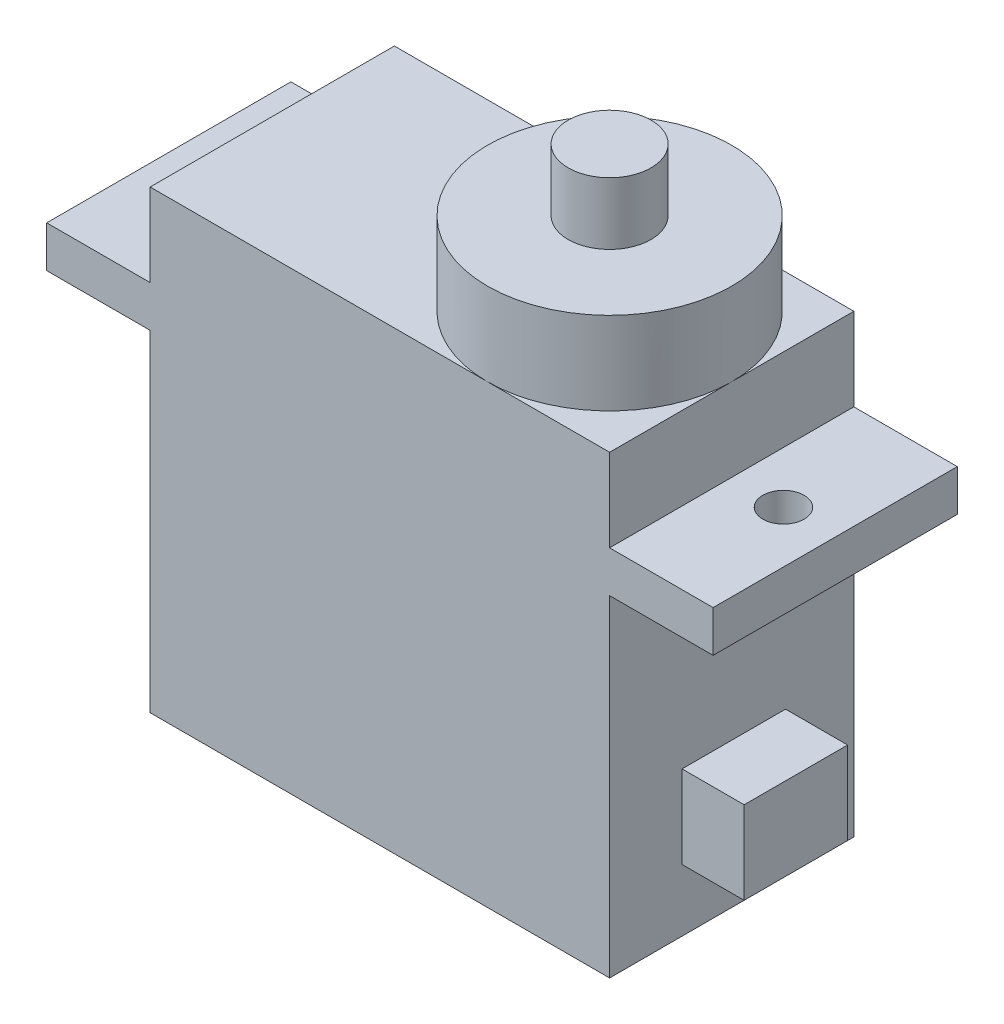
ISO-10303-21;
HEADER;
FILE_DESCRIPTION(('STEP AP214'),'2;1');
FILE_NAME('part.step','',(''),(''),'','','');
FILE_SCHEMA(('AUTOMOTIVE_DESIGN { 1 0 10303 214 1 1 1 1 }'));
ENDSEC;
DATA;
#1=APPLICATION_CONTEXT('core data for automotive mechanical design processes');
#2=APPLICATION_PROTOCOL_DEFINITION('international standard','automotive_design',2000,#1);
#3=PRODUCT_CONTEXT('',#1,'mechanical');
#4=PRODUCT('Part','Part','',(#3));
#5=PRODUCT_RELATED_PRODUCT_CATEGORY('part','',(#4));
#6=PRODUCT_DEFINITION_FORMATION('','',#4);
#7=PRODUCT_DEFINITION_CONTEXT('part definition',#1,'design');
#8=PRODUCT_DEFINITION('design','',#6,#7);
#9=PRODUCT_DEFINITION_SHAPE('','',#8);
#10=(LENGTH_UNIT() NAMED_UNIT(*) SI_UNIT(.MILLI.,.METRE.));
#11=(NAMED_UNIT(*) PLANE_ANGLE_UNIT() SI_UNIT($,.RADIAN.));
#12=(NAMED_UNIT(*) SI_UNIT($,.STERADIAN.) SOLID_ANGLE_UNIT());
#13=UNCERTAINTY_MEASURE_WITH_UNIT(LENGTH_MEASURE(1.E-05),#10,'distance_accuracy_value','');
#14=(GEOMETRIC_REPRESENTATION_CONTEXT(3) GLOBAL_UNCERTAINTY_ASSIGNED_CONTEXT((#13)) GLOBAL_UNIT_ASSIGNED_CONTEXT((#10,
#11,#12)) REPRESENTATION_CONTEXT('',''));
#15=CARTESIAN_POINT('',(0.,0.,0.));
#16=DIRECTION('',(0.,0.,1.));
#17=DIRECTION('',(1.,0.,0.));
#18=AXIS2_PLACEMENT_3D('',#15,#16,#17);
#19=CARTESIAN_POINT('',(-17.9964599489545,16.,11.8));
#20=DIRECTION('',(-1.,0.,0.));
#21=DIRECTION('',(0.,0.,1.));
#22=AXIS2_PLACEMENT_3D('',#19,#20,#21);
#23=PLANE('',#22);
#24=DIRECTION('',(0.,1.,0.));
#25=VECTOR('',#24,1.);
#26=CARTESIAN_POINT('',(-17.9964599489545,16.,0.));
#27=LINE('',#26,#25);
#28=CARTESIAN_POINT('',(-17.9964599489545,0.,0.));
#29=VERTEX_POINT('',#28);
#30=CARTESIAN_POINT('',(-17.9964599489545,16.,0.));
#31=VERTEX_POINT('',#30);
#32=EDGE_CURVE('E242',#29,#31,#27,.T.);
#33=ORIENTED_EDGE('',*,*,#32,.T.);
#34=DIRECTION('',(0.,0.,-1.));
#35=VECTOR('',#34,1.);
#36=CARTESIAN_POINT('',(-17.9964599489545,16.,11.8));
#37=LINE('',#36,#35);
#38=CARTESIAN_POINT('',(-17.9964599489545,16.,11.8));
#39=VERTEX_POINT('',#38);
#40=EDGE_CURVE('E281',#39,#31,#37,.T.);
#41=ORIENTED_EDGE('',*,*,#40,.F.);
#42=DIRECTION('',(0.,1.,0.));
#43=VECTOR('',#42,1.);
#44=CARTESIAN_POINT('',(-17.9964599489545,16.,11.8));
#45=LINE('',#44,#43);
#46=CARTESIAN_POINT('',(-17.9964599489545,0.,11.8));
#47=VERTEX_POINT('',#46);
#48=EDGE_CURVE('E216',#47,#39,#45,.T.);
#49=ORIENTED_EDGE('',*,*,#48,.F.);
#50=DIRECTION('',(0.,0.,-1.));
#51=VECTOR('',#50,1.);
#52=CARTESIAN_POINT('',(-17.9964599489545,0.,11.8));
#53=LINE('',#52,#51);
#54=EDGE_CURVE('E284',#47,#29,#53,.T.);
#55=ORIENTED_EDGE('',*,*,#54,.T.);
#56=EDGE_LOOP('',(#33,#41,#49,#55));
#57=FACE_BOUND('',#56,.T.);
#58=DIRECTION('',(0.,-1.,0.));
#59=VECTOR('',#58,1.);
#60=CARTESIAN_POINT('',(-17.9964599489545,2.99999999999999,8.3));
#61=LINE('',#60,#59);
#62=CARTESIAN_POINT('',(-17.9964599489545,6.99999999999999,8.3));
#63=VERTEX_POINT('',#62);
#64=CARTESIAN_POINT('',(-17.9964599489545,3.,8.3));
#65=VERTEX_POINT('',#64);
#66=EDGE_CURVE('E177',#63,#65,#61,.T.);
#67=ORIENTED_EDGE('',*,*,#66,.F.);
#68=DIRECTION('',(0.,0.,1.));
#69=VECTOR('',#68,1.);
#70=CARTESIAN_POINT('',(-17.9964599489545,6.99999999999999,8.3));
#71=LINE('',#70,#69);
#72=CARTESIAN_POINT('',(-17.9964599489545,7.,3.3));
#73=VERTEX_POINT('',#72);
#74=EDGE_CURVE('E174',#73,#63,#71,.T.);
#75=ORIENTED_EDGE('',*,*,#74,.F.);
#76=DIRECTION('',(0.,1.,0.));
#77=VECTOR('',#76,1.);
#78=CARTESIAN_POINT('',(-17.9964599489545,2.99999999999999,3.3));
#79=LINE('',#78,#77);
#80=CARTESIAN_POINT('',(-17.9964599489545,2.99999999999999,3.3));
#81=VERTEX_POINT('',#80);
#82=EDGE_CURVE('E55',#81,#73,#79,.T.);
#83=ORIENTED_EDGE('',*,*,#82,.F.);
#84=DIRECTION('',(0.,0.,-1.));
#85=VECTOR('',#84,1.);
#86=CARTESIAN_POINT('',(-17.9964599489545,2.99999999999999,8.3));
#87=LINE('',#86,#85);
#88=EDGE_CURVE('E50',#65,#81,#87,.T.);
#89=ORIENTED_EDGE('',*,*,#88,.F.);
#90=EDGE_LOOP('',(#67,#75,#83,#89));
#91=FACE_BOUND('',#90,.T.);
#92=ADVANCED_FACE('F32',(#57,#91),#23,.F.);
#93=CARTESIAN_POINT('',(-23.8964599489545,26.,5.9));
#94=DIRECTION('',(0.,1.,0.));
#95=DIRECTION('',(0.,0.,1.));
#96=AXIS2_PLACEMENT_3D('',#93,#94,#95);
#97=PLANE('',#96);
#98=CARTESIAN_POINT('',(-23.8964599489545,26.,5.9));
#99=DIRECTION('',(0.,1.,0.));
#100=DIRECTION('',(0.,0.,1.));
#101=AXIS2_PLACEMENT_3D('',#98,#99,#100);
#102=CIRCLE('',#101,5.9);
#103=CARTESIAN_POINT('',(-23.8964599489545,26.,11.8));
#104=VERTEX_POINT('',#103);
#105=EDGE_CURVE('E189',#104,#104,#102,.T.);
#106=ORIENTED_EDGE('',*,*,#105,.T.);
#107=EDGE_LOOP('',(#106));
#108=FACE_BOUND('',#107,.T.);
#109=CARTESIAN_POINT('',(-23.8964599489545,26.,5.9));
#110=DIRECTION('',(0.,1.,0.));
#111=DIRECTION('',(0.,0.,1.));
#112=AXIS2_PLACEMENT_3D('',#109,#110,#111);
#113=CIRCLE('',#112,2.);
#114=CARTESIAN_POINT('',(-23.8964599489545,26.,7.9));
#115=VERTEX_POINT('',#114);
#116=EDGE_CURVE('E178',#115,#115,#113,.T.);
#117=ORIENTED_EDGE('',*,*,#116,.F.);
#118=EDGE_LOOP('',(#117));
#119=FACE_BOUND('',#118,.T.);
#120=ADVANCED_FACE('F364',(#108,#119),#97,.T.);
#121=CARTESIAN_POINT('',(-40.1964599489545,22.,11.8));
#122=DIRECTION('',(0.,-1.,0.));
#123=DIRECTION('',(0.,0.,-1.));
#124=AXIS2_PLACEMENT_3D('',#121,#122,#123);
#125=PLANE('',#124);
#126=CARTESIAN_POINT('',(-23.8964599489545,22.,5.9));
#127=DIRECTION('',(0.,1.,0.));
#128=DIRECTION('',(0.,0.,1.));
#129=AXIS2_PLACEMENT_3D('',#126,#127,#128);
#130=CIRCLE('',#129,5.9);
#131=CARTESIAN_POINT('',(-23.8964599489545,22.,11.8));
#132=VERTEX_POINT('',#131);
#133=CARTESIAN_POINT('',(-17.9964599489545,22.,5.9));
#134=VERTEX_POINT('',#133);
#135=EDGE_CURVE('E43',#132,#134,#130,.T.);
#136=ORIENTED_EDGE('',*,*,#135,.F.);
#137=DIRECTION('',(-1.,0.,0.));
#138=VECTOR('',#137,1.);
#139=CARTESIAN_POINT('',(-40.1964599489545,22.,11.8));
#140=LINE('',#139,#138);
#141=CARTESIAN_POINT('',(-17.9964599489545,22.,11.8));
#142=VERTEX_POINT('',#141);
#143=EDGE_CURVE('E227',#142,#132,#140,.T.);
#144=ORIENTED_EDGE('',*,*,#143,.F.);
#145=DIRECTION('',(0.,0.,-1.));
#146=VECTOR('',#145,1.);
#147=CARTESIAN_POINT('',(-17.9964599489545,22.,11.8));
#148=LINE('',#147,#146);
#149=EDGE_CURVE('E269',#142,#134,#148,.T.);
#150=ORIENTED_EDGE('',*,*,#149,.T.);
#151=EDGE_LOOP('',(#136,#144,#150));
#152=FACE_BOUND('',#151,.T.);
#153=ADVANCED_FACE('F362',(#152),#125,.F.);
#154=CARTESIAN_POINT('',(-23.8964599489545,22.,0.));
#155=VERTEX_POINT('',#154);
#156=EDGE_CURVE('E11',#134,#155,#130,.T.);
#157=ORIENTED_EDGE('',*,*,#156,.F.);
#158=CARTESIAN_POINT('',(-17.9964599489545,22.,0.));
#159=VERTEX_POINT('',#158);
#160=EDGE_CURVE('E268',#134,#159,#148,.T.);
#161=ORIENTED_EDGE('',*,*,#160,.T.);
#162=DIRECTION('',(-1.,0.,0.));
#163=VECTOR('',#162,1.);
#164=CARTESIAN_POINT('',(-40.1964599489545,22.,0.));
#165=LINE('',#164,#163);
#166=EDGE_CURVE('E254',#159,#155,#165,.T.);
#167=ORIENTED_EDGE('',*,*,#166,.T.);
#168=EDGE_LOOP('',(#157,#161,#167));
#169=FACE_BOUND('',#168,.T.);
#170=ADVANCED_FACE('F315',(#169),#125,.F.);
#171=EDGE_CURVE('E41',#155,#132,#130,.T.);
#172=ORIENTED_EDGE('',*,*,#171,.F.);
#173=CARTESIAN_POINT('',(-40.1964599489545,22.,0.));
#174=VERTEX_POINT('',#173);
#175=EDGE_CURVE('E253',#155,#174,#165,.T.);
#176=ORIENTED_EDGE('',*,*,#175,.T.);
#177=DIRECTION('',(0.,0.,-1.));
#178=VECTOR('',#177,1.);
#179=CARTESIAN_POINT('',(-40.1964599489545,22.,11.8));
#180=LINE('',#179,#178);
#181=CARTESIAN_POINT('',(-40.1964599489545,22.,11.8));
#182=VERTEX_POINT('',#181);
#183=EDGE_CURVE('E265',#182,#174,#180,.T.);
#184=ORIENTED_EDGE('',*,*,#183,.F.);
#185=EDGE_CURVE('E226',#132,#182,#140,.T.);
#186=ORIENTED_EDGE('',*,*,#185,.F.);
#187=EDGE_LOOP('',(#172,#176,#184,#186));
#188=FACE_BOUND('',#187,.T.);
#189=ADVANCED_FACE('F305',(#188),#125,.F.);
#190=CARTESIAN_POINT('',(-45.1964599489545,16.,11.8));
#191=DIRECTION('',(1.,0.,0.));
#192=DIRECTION('',(0.,0.,-1.));
#193=AXIS2_PLACEMENT_3D('',#190,#191,#192);
#194=PLANE('',#193);
#195=DIRECTION('',(0.,-1.,0.));
#196=VECTOR('',#195,1.);
#197=CARTESIAN_POINT('',(-45.1964599489545,16.,0.));
#198=LINE('',#197,#196);
#199=CARTESIAN_POINT('',(-45.1964599489545,18.,0.));
#200=VERTEX_POINT('',#199);
#201=CARTESIAN_POINT('',(-45.1964599489545,16.,0.));
#202=VERTEX_POINT('',#201);
#203=EDGE_CURVE('E205',#200,#202,#198,.T.);
#204=ORIENTED_EDGE('',*,*,#203,.T.);
#205=DIRECTION('',(0.,0.,-1.));
#206=VECTOR('',#205,1.);
#207=CARTESIAN_POINT('',(-45.1964599489545,16.,11.8));
#208=LINE('',#207,#206);
#209=CARTESIAN_POINT('',(-45.1964599489545,16.,11.8));
#210=VERTEX_POINT('',#209);
#211=EDGE_CURVE('E36',#210,#202,#208,.T.);
#212=ORIENTED_EDGE('',*,*,#211,.F.);
#213=DIRECTION('',(0.,-1.,0.));
#214=VECTOR('',#213,1.);
#215=CARTESIAN_POINT('',(-45.1964599489545,16.,11.8));
#216=LINE('',#215,#214);
#217=CARTESIAN_POINT('',(-45.1964599489545,18.,11.8));
#218=VERTEX_POINT('',#217);
#219=EDGE_CURVE('E206',#218,#210,#216,.T.);
#220=ORIENTED_EDGE('',*,*,#219,.F.);
#221=DIRECTION('',(0.,0.,-1.));
#222=VECTOR('',#221,1.);
#223=CARTESIAN_POINT('',(-45.1964599489545,18.,11.8));
#224=LINE('',#223,#222);
#225=EDGE_CURVE('E233',#218,#200,#224,.T.);
#226=ORIENTED_EDGE('',*,*,#225,.T.);
#227=EDGE_LOOP('',(#204,#212,#220,#226));
#228=FACE_BOUND('',#227,.T.);
#229=ADVANCED_FACE('F34',(#228),#194,.F.);
#230=CARTESIAN_POINT('',(-40.1964599489545,16.,11.8));
#231=DIRECTION('',(0.,1.,0.));
#232=DIRECTION('',(-1.,0.,0.));
#233=AXIS2_PLACEMENT_3D('',#230,#231,#232);
#234=PLANE('',#233);
#235=CARTESIAN_POINT('',(-42.6964599489545,16.,5.9));
#236=DIRECTION('',(0.,1.,0.));
#237=DIRECTION('',(-1.,0.,0.));
#238=AXIS2_PLACEMENT_3D('',#235,#236,#237);
#239=CIRCLE('',#238,0.999999999999998);
#240=CARTESIAN_POINT('',(-43.6964599489545,16.,5.9));
#241=VERTEX_POINT('',#240);
#242=EDGE_CURVE('E202',#241,#241,#239,.T.);
#243=ORIENTED_EDGE('',*,*,#242,.T.);
#244=EDGE_LOOP('',(#243));
#245=FACE_BOUND('',#244,.T.);
#246=DIRECTION('',(1.,0.,0.));
#247=VECTOR('',#246,1.);
#248=CARTESIAN_POINT('',(-40.1964599489545,16.,0.));
#249=LINE('',#248,#247);
#250=CARTESIAN_POINT('',(-40.1964599489545,16.,0.));
#251=VERTEX_POINT('',#250);
#252=EDGE_CURVE('E236',#202,#251,#249,.T.);
#253=ORIENTED_EDGE('',*,*,#252,.T.);
#254=DIRECTION('',(0.,0.,-1.));
#255=VECTOR('',#254,1.);
#256=CARTESIAN_POINT('',(-40.1964599489545,16.,11.8));
#257=LINE('',#256,#255);
#258=CARTESIAN_POINT('',(-40.1964599489545,16.,11.8));
#259=VERTEX_POINT('',#258);
#260=EDGE_CURVE('E289',#259,#251,#257,.T.);
#261=ORIENTED_EDGE('',*,*,#260,.F.);
#262=DIRECTION('',(1.,0.,0.));
#263=VECTOR('',#262,1.);
#264=CARTESIAN_POINT('',(-40.1964599489545,16.,11.8));
#265=LINE('',#264,#263);
#266=EDGE_CURVE('E209',#210,#259,#265,.T.);
#267=ORIENTED_EDGE('',*,*,#266,.F.);
#268=ORIENTED_EDGE('',*,*,#211,.T.);
#269=EDGE_LOOP('',(#253,#261,#267,#268));
#270=FACE_BOUND('',#269,.T.);
#271=ADVANCED_FACE('F347',(#245,#270),#234,.F.);
#272=CARTESIAN_POINT('',(-40.1964599489545,0.,11.8));
#273=DIRECTION('',(1.,0.,0.));
#274=DIRECTION('',(0.,0.,-1.));
#275=AXIS2_PLACEMENT_3D('',#272,#273,#274);
#276=PLANE('',#275);
#277=DIRECTION('',(0.,-1.,0.));
#278=VECTOR('',#277,1.);
#279=CARTESIAN_POINT('',(-40.1964599489545,0.,0.));
#280=LINE('',#279,#278);
#281=CARTESIAN_POINT('',(-40.1964599489545,0.,0.));
#282=VERTEX_POINT('',#281);
#283=EDGE_CURVE('E238',#251,#282,#280,.T.);
#284=ORIENTED_EDGE('',*,*,#283,.T.);
#285=DIRECTION('',(0.,0.,-1.));
#286=VECTOR('',#285,1.);
#287=CARTESIAN_POINT('',(-40.1964599489545,0.,11.8));
#288=LINE('',#287,#286);
#289=CARTESIAN_POINT('',(-40.1964599489545,0.,11.8));
#290=VERTEX_POINT('',#289);
#291=EDGE_CURVE('E287',#290,#282,#288,.T.);
#292=ORIENTED_EDGE('',*,*,#291,.F.);
#293=DIRECTION('',(0.,-1.,0.));
#294=VECTOR('',#293,1.);
#295=CARTESIAN_POINT('',(-40.1964599489545,0.,11.8));
#296=LINE('',#295,#294);
#297=EDGE_CURVE('E212',#259,#290,#296,.T.);
#298=ORIENTED_EDGE('',*,*,#297,.F.);
#299=ORIENTED_EDGE('',*,*,#260,.T.);
#300=EDGE_LOOP('',(#284,#292,#298,#299));
#301=FACE_BOUND('',#300,.T.);
#302=ADVANCED_FACE('F346',(#301),#276,.F.);
#303=CARTESIAN_POINT('',(-17.9964599489545,0.,11.8));
#304=DIRECTION('',(0.,1.,0.));
#305=DIRECTION('',(-1.,0.,0.));
#306=AXIS2_PLACEMENT_3D('',#303,#304,#305);
#307=PLANE('',#306);
#308=DIRECTION('',(1.,0.,0.));
#309=VECTOR('',#308,1.);
#310=CARTESIAN_POINT('',(-17.9964599489545,0.,0.));
#311=LINE('',#310,#309);
#312=EDGE_CURVE('E240',#282,#29,#311,.T.);
#313=ORIENTED_EDGE('',*,*,#312,.T.);
#314=ORIENTED_EDGE('',*,*,#54,.F.);
#315=DIRECTION('',(1.,0.,0.));
#316=VECTOR('',#315,1.);
#317=CARTESIAN_POINT('',(-17.9964599489545,0.,11.8));
#318=LINE('',#317,#316);
#319=EDGE_CURVE('E214',#290,#47,#318,.T.);
#320=ORIENTED_EDGE('',*,*,#319,.F.);
#321=ORIENTED_EDGE('',*,*,#291,.T.);
#322=EDGE_LOOP('',(#313,#314,#320,#321));
#323=FACE_BOUND('',#322,.T.);
#324=ADVANCED_FACE('F344',(#323),#307,.F.);
#325=CARTESIAN_POINT('',(-12.9964599489545,16.,11.8));
#326=DIRECTION('',(0.,1.,0.));
#327=DIRECTION('',(0.,0.,1.));
#328=AXIS2_PLACEMENT_3D('',#325,#326,#327);
#329=PLANE('',#328);
#330=CARTESIAN_POINT('',(-15.4964599489545,16.,5.9));
#331=DIRECTION('',(0.,1.,0.));
#332=DIRECTION('',(0.,0.,1.));
#333=AXIS2_PLACEMENT_3D('',#330,#331,#332);
#334=CIRCLE('',#333,1.);
#335=CARTESIAN_POINT('',(-15.4964599489545,16.,6.9));
#336=VERTEX_POINT('',#335);
#337=EDGE_CURVE('E196',#336,#336,#334,.T.);
#338=ORIENTED_EDGE('',*,*,#337,.T.);
#339=EDGE_LOOP('',(#338));
#340=FACE_BOUND('',#339,.T.);
#341=DIRECTION('',(1.,0.,0.));
#342=VECTOR('',#341,1.);
#343=CARTESIAN_POINT('',(-12.9964599489545,16.,0.));
#344=LINE('',#343,#342);
#345=CARTESIAN_POINT('',(-12.9964599489545,16.,0.));
#346=VERTEX_POINT('',#345);
#347=EDGE_CURVE('E244',#31,#346,#344,.T.);
#348=ORIENTED_EDGE('',*,*,#347,.T.);
#349=DIRECTION('',(0.,0.,-1.));
#350=VECTOR('',#349,1.);
#351=CARTESIAN_POINT('',(-12.9964599489545,16.,11.8));
#352=LINE('',#351,#350);
#353=CARTESIAN_POINT('',(-12.9964599489545,16.,11.8));
#354=VERTEX_POINT('',#353);
#355=EDGE_CURVE('E278',#354,#346,#352,.T.);
#356=ORIENTED_EDGE('',*,*,#355,.F.);
#357=DIRECTION('',(1.,0.,0.));
#358=VECTOR('',#357,1.);
#359=CARTESIAN_POINT('',(-12.9964599489545,16.,11.8));
#360=LINE('',#359,#358);
#361=EDGE_CURVE('E218',#39,#354,#360,.T.);
#362=ORIENTED_EDGE('',*,*,#361,.F.);
#363=ORIENTED_EDGE('',*,*,#40,.T.);
#364=EDGE_LOOP('',(#348,#356,#362,#363));
#365=FACE_BOUND('',#364,.T.);
#366=ADVANCED_FACE('F335',(#340,#365),#329,.F.);
#367=CARTESIAN_POINT('',(-12.9964599489545,18.,11.8));
#368=DIRECTION('',(-1.,0.,0.));
#369=DIRECTION('',(0.,0.,1.));
#370=AXIS2_PLACEMENT_3D('',#367,#368,#369);
#371=PLANE('',#370);
#372=DIRECTION('',(0.,1.,0.));
#373=VECTOR('',#372,1.);
#374=CARTESIAN_POINT('',(-12.9964599489545,18.,0.));
#375=LINE('',#374,#373);
#376=CARTESIAN_POINT('',(-12.9964599489545,18.,0.));
#377=VERTEX_POINT('',#376);
#378=EDGE_CURVE('E246',#346,#377,#375,.T.);
#379=ORIENTED_EDGE('',*,*,#378,.T.);
#380=DIRECTION('',(0.,0.,-1.));
#381=VECTOR('',#380,1.);
#382=CARTESIAN_POINT('',(-12.9964599489545,18.,11.8));
#383=LINE('',#382,#381);
#384=CARTESIAN_POINT('',(-12.9964599489545,18.,11.8));
#385=VERTEX_POINT('',#384);
#386=EDGE_CURVE('E275',#385,#377,#383,.T.);
#387=ORIENTED_EDGE('',*,*,#386,.F.);
#388=DIRECTION('',(0.,1.,0.));
#389=VECTOR('',#388,1.);
#390=CARTESIAN_POINT('',(-12.9964599489545,18.,11.8));
#391=LINE('',#390,#389);
#392=EDGE_CURVE('E220',#354,#385,#391,.T.);
#393=ORIENTED_EDGE('',*,*,#392,.F.);
#394=ORIENTED_EDGE('',*,*,#355,.T.);
#395=EDGE_LOOP('',(#379,#387,#393,#394));
#396=FACE_BOUND('',#395,.T.);
#397=ADVANCED_FACE('F331',(#396),#371,.F.);
#398=CARTESIAN_POINT('',(-17.9964599489545,18.,11.8));
#399=DIRECTION('',(0.,-1.,0.));
#400=DIRECTION('',(0.,0.,-1.));
#401=AXIS2_PLACEMENT_3D('',#398,#399,#400);
#402=PLANE('',#401);
#403=CARTESIAN_POINT('',(-15.4964599489545,18.,5.9));
#404=DIRECTION('',(0.,1.,0.));
#405=DIRECTION('',(0.,0.,1.));
#406=AXIS2_PLACEMENT_3D('',#403,#404,#405);
#407=CIRCLE('',#406,1.);
#408=CARTESIAN_POINT('',(-15.4964599489545,18.,6.9));
#409=VERTEX_POINT('',#408);
#410=EDGE_CURVE('E191',#409,#409,#407,.T.);
#411=ORIENTED_EDGE('',*,*,#410,.F.);
#412=EDGE_LOOP('',(#411));
#413=FACE_BOUND('',#412,.T.);
#414=DIRECTION('',(-1.,0.,0.));
#415=VECTOR('',#414,1.);
#416=CARTESIAN_POINT('',(-17.9964599489545,18.,0.));
#417=LINE('',#416,#415);
#418=CARTESIAN_POINT('',(-17.9964599489545,18.,0.));
#419=VERTEX_POINT('',#418);
#420=EDGE_CURVE('E248',#377,#419,#417,.T.);
#421=ORIENTED_EDGE('',*,*,#420,.T.);
#422=DIRECTION('',(0.,0.,-1.));
#423=VECTOR('',#422,1.);
#424=CARTESIAN_POINT('',(-17.9964599489545,18.,11.8));
#425=LINE('',#424,#423);
#426=CARTESIAN_POINT('',(-17.9964599489545,18.,11.8));
#427=VERTEX_POINT('',#426);
#428=EDGE_CURVE('E272',#427,#419,#425,.T.);
#429=ORIENTED_EDGE('',*,*,#428,.F.);
#430=DIRECTION('',(-1.,0.,0.));
#431=VECTOR('',#430,1.);
#432=CARTESIAN_POINT('',(-17.9964599489545,18.,11.8));
#433=LINE('',#432,#431);
#434=EDGE_CURVE('E222',#385,#427,#433,.T.);
#435=ORIENTED_EDGE('',*,*,#434,.F.);
#436=ORIENTED_EDGE('',*,*,#386,.T.);
#437=EDGE_LOOP('',(#421,#429,#435,#436));
#438=FACE_BOUND('',#437,.T.);
#439=ADVANCED_FACE('F326',(#413,#438),#402,.F.);
#440=CARTESIAN_POINT('',(-17.9964599489545,22.,11.8));
#441=DIRECTION('',(-1.,0.,0.));
#442=DIRECTION('',(0.,-1.,0.));
#443=AXIS2_PLACEMENT_3D('',#440,#441,#442);
#444=PLANE('',#443);
#445=DIRECTION('',(0.,1.,0.));
#446=VECTOR('',#445,1.);
#447=CARTESIAN_POINT('',(-17.9964599489545,22.,0.));
#448=LINE('',#447,#446);
#449=EDGE_CURVE('E250',#419,#159,#448,.T.);
#450=ORIENTED_EDGE('',*,*,#449,.T.);
#451=ORIENTED_EDGE('',*,*,#160,.F.);
#452=ORIENTED_EDGE('',*,*,#149,.F.);
#453=DIRECTION('',(0.,1.,0.));
#454=VECTOR('',#453,1.);
#455=CARTESIAN_POINT('',(-17.9964599489545,22.,11.8));
#456=LINE('',#455,#454);
#457=EDGE_CURVE('E224',#427,#142,#456,.T.);
#458=ORIENTED_EDGE('',*,*,#457,.F.);
#459=ORIENTED_EDGE('',*,*,#428,.T.);
#460=EDGE_LOOP('',(#450,#451,#452,#458,#459));
#461=FACE_BOUND('',#460,.T.);
#462=ADVANCED_FACE('F319',(#461),#444,.F.);
#463=CARTESIAN_POINT('',(-40.1964599489545,18.,11.8));
#464=DIRECTION('',(1.,0.,0.));
#465=DIRECTION('',(0.,0.,-1.));
#466=AXIS2_PLACEMENT_3D('',#463,#464,#465);
#467=PLANE('',#466);
#468=DIRECTION('',(0.,-1.,0.));
#469=VECTOR('',#468,1.);
#470=CARTESIAN_POINT('',(-40.1964599489545,18.,0.));
#471=LINE('',#470,#469);
#472=CARTESIAN_POINT('',(-40.1964599489545,18.,0.));
#473=VERTEX_POINT('',#472);
#474=EDGE_CURVE('E257',#174,#473,#471,.T.);
#475=ORIENTED_EDGE('',*,*,#474,.T.);
#476=DIRECTION('',(0.,0.,-1.));
#477=VECTOR('',#476,1.);
#478=CARTESIAN_POINT('',(-40.1964599489545,18.,11.8));
#479=LINE('',#478,#477);
#480=CARTESIAN_POINT('',(-40.1964599489545,18.,11.8));
#481=VERTEX_POINT('',#480);
#482=EDGE_CURVE('E262',#481,#473,#479,.T.);
#483=ORIENTED_EDGE('',*,*,#482,.F.);
#484=DIRECTION('',(0.,-1.,0.));
#485=VECTOR('',#484,1.);
#486=CARTESIAN_POINT('',(-40.1964599489545,18.,11.8));
#487=LINE('',#486,#485);
#488=EDGE_CURVE('E229',#182,#481,#487,.T.);
#489=ORIENTED_EDGE('',*,*,#488,.F.);
#490=ORIENTED_EDGE('',*,*,#183,.T.);
#491=EDGE_LOOP('',(#475,#483,#489,#490));
#492=FACE_BOUND('',#491,.T.);
#493=ADVANCED_FACE('F359',(#492),#467,.F.);
#494=CARTESIAN_POINT('',(-45.1964599489545,18.,11.8));
#495=DIRECTION('',(0.,-1.,0.));
#496=DIRECTION('',(0.,0.,-1.));
#497=AXIS2_PLACEMENT_3D('',#494,#495,#496);
#498=PLANE('',#497);
#499=CARTESIAN_POINT('',(-42.6964599489545,18.,5.9));
#500=DIRECTION('',(0.,1.,0.));
#501=DIRECTION('',(0.,0.,1.));
#502=AXIS2_PLACEMENT_3D('',#499,#500,#501);
#503=CIRCLE('',#502,0.999999999999998);
#504=CARTESIAN_POINT('',(-42.6964599489545,18.,6.9));
#505=VERTEX_POINT('',#504);
#506=EDGE_CURVE('E199',#505,#505,#503,.T.);
#507=ORIENTED_EDGE('',*,*,#506,.F.);
#508=EDGE_LOOP('',(#507));
#509=FACE_BOUND('',#508,.T.);
#510=DIRECTION('',(-1.,0.,0.));
#511=VECTOR('',#510,1.);
#512=CARTESIAN_POINT('',(-45.1964599489545,18.,0.));
#513=LINE('',#512,#511);
#514=EDGE_CURVE('E210',#473,#200,#513,.T.);
#515=ORIENTED_EDGE('',*,*,#514,.T.);
#516=ORIENTED_EDGE('',*,*,#225,.F.);
#517=DIRECTION('',(-1.,0.,0.));
#518=VECTOR('',#517,1.);
#519=CARTESIAN_POINT('',(-45.1964599489545,18.,11.8));
#520=LINE('',#519,#518);
#521=EDGE_CURVE('E231',#481,#218,#520,.T.);
#522=ORIENTED_EDGE('',*,*,#521,.F.);
#523=ORIENTED_EDGE('',*,*,#482,.T.);
#524=EDGE_LOOP('',(#515,#516,#522,#523));
#525=FACE_BOUND('',#524,.T.);
#526=ADVANCED_FACE('F355',(#509,#525),#498,.F.);
#527=CARTESIAN_POINT('',(0.,0.,11.8));
#528=DIRECTION('',(0.,0.,-1.));
#529=DIRECTION('',(-1.,0.,0.));
#530=AXIS2_PLACEMENT_3D('',#527,#528,#529);
#531=PLANE('',#530);
#532=ORIENTED_EDGE('',*,*,#219,.T.);
#533=ORIENTED_EDGE('',*,*,#266,.T.);
#534=ORIENTED_EDGE('',*,*,#297,.T.);
#535=ORIENTED_EDGE('',*,*,#319,.T.);
#536=ORIENTED_EDGE('',*,*,#48,.T.);
#537=ORIENTED_EDGE('',*,*,#361,.T.);
#538=ORIENTED_EDGE('',*,*,#392,.T.);
#539=ORIENTED_EDGE('',*,*,#434,.T.);
#540=ORIENTED_EDGE('',*,*,#457,.T.);
#541=ORIENTED_EDGE('',*,*,#143,.T.);
#542=ORIENTED_EDGE('',*,*,#185,.T.);
#543=ORIENTED_EDGE('',*,*,#488,.T.);
#544=ORIENTED_EDGE('',*,*,#521,.T.);
#545=EDGE_LOOP('',(#532,#533,#534,#535,#536,#537,#538,#539,#540,#541,#542,#543,#544));
#546=FACE_BOUND('',#545,.T.);
#547=ADVANCED_FACE('F350',(#546),#531,.F.);
#548=CARTESIAN_POINT('',(0.,0.,0.));
#549=DIRECTION('',(0.,0.,-1.));
#550=DIRECTION('',(-1.,0.,0.));
#551=AXIS2_PLACEMENT_3D('',#548,#549,#550);
#552=PLANE('',#551);
#553=ORIENTED_EDGE('',*,*,#203,.F.);
#554=ORIENTED_EDGE('',*,*,#514,.F.);
#555=ORIENTED_EDGE('',*,*,#474,.F.);
#556=ORIENTED_EDGE('',*,*,#175,.F.);
#557=ORIENTED_EDGE('',*,*,#166,.F.);
#558=ORIENTED_EDGE('',*,*,#449,.F.);
#559=ORIENTED_EDGE('',*,*,#420,.F.);
#560=ORIENTED_EDGE('',*,*,#378,.F.);
#561=ORIENTED_EDGE('',*,*,#347,.F.);
#562=ORIENTED_EDGE('',*,*,#32,.F.);
#563=ORIENTED_EDGE('',*,*,#312,.F.);
#564=ORIENTED_EDGE('',*,*,#283,.F.);
#565=ORIENTED_EDGE('',*,*,#252,.F.);
#566=EDGE_LOOP('',(#553,#554,#555,#556,#557,#558,#559,#560,#561,#562,#563,#564,#565));
#567=FACE_BOUND('',#566,.T.);
#568=ADVANCED_FACE('F311',(#567),#552,.T.);
#569=CARTESIAN_POINT('',(-42.6964599489545,6.2,5.9));
#570=DIRECTION('',(0.,1.,0.));
#571=DIRECTION('',(0.,0.,1.));
#572=AXIS2_PLACEMENT_3D('',#569,#570,#571);
#573=CYLINDRICAL_SURFACE('',#572,0.999999999999998);
#574=ORIENTED_EDGE('',*,*,#506,.T.);
#575=EDGE_LOOP('',(#574));
#576=FACE_BOUND('',#575,.T.);
#577=ORIENTED_EDGE('',*,*,#242,.F.);
#578=EDGE_LOOP('',(#577));
#579=FACE_BOUND('',#578,.T.);
#580=ADVANCED_FACE('F392',(#576,#579),#573,.F.);
#581=CARTESIAN_POINT('',(-15.4964599489545,6.2,5.9));
#582=DIRECTION('',(0.,1.,0.));
#583=DIRECTION('',(0.,0.,1.));
#584=AXIS2_PLACEMENT_3D('',#581,#582,#583);
#585=CYLINDRICAL_SURFACE('',#584,1.);
#586=ORIENTED_EDGE('',*,*,#410,.T.);
#587=EDGE_LOOP('',(#586));
#588=FACE_BOUND('',#587,.T.);
#589=ORIENTED_EDGE('',*,*,#337,.F.);
#590=EDGE_LOOP('',(#589));
#591=FACE_BOUND('',#590,.T.);
#592=ADVANCED_FACE('F394',(#588,#591),#585,.F.);
#593=CARTESIAN_POINT('',(-23.8964599489545,26.,5.9));
#594=DIRECTION('',(0.,-1.,0.));
#595=DIRECTION('',(0.,0.,-1.));
#596=AXIS2_PLACEMENT_3D('',#593,#594,#595);
#597=CYLINDRICAL_SURFACE('',#596,5.9);
#598=ORIENTED_EDGE('',*,*,#105,.F.);
#599=EDGE_LOOP('',(#598));
#600=FACE_BOUND('',#599,.T.);
#601=ORIENTED_EDGE('',*,*,#135,.T.);
#602=ORIENTED_EDGE('',*,*,#156,.T.);
#603=ORIENTED_EDGE('',*,*,#171,.T.);
#604=EDGE_LOOP('',(#601,#602,#603));
#605=FACE_BOUND('',#604,.T.);
#606=ADVANCED_FACE('F300',(#600,#605),#597,.T.);
#607=CARTESIAN_POINT('',(-23.8964599489545,29.,5.9));
#608=DIRECTION('',(0.,-1.,0.));
#609=DIRECTION('',(0.,0.,-1.));
#610=AXIS2_PLACEMENT_3D('',#607,#608,#609);
#611=CYLINDRICAL_SURFACE('',#610,2.);
#612=CARTESIAN_POINT('',(-23.8964599489545,29.,5.9));
#613=DIRECTION('',(0.,1.,0.));
#614=DIRECTION('',(0.,0.,1.));
#615=AXIS2_PLACEMENT_3D('',#612,#613,#614);
#616=CIRCLE('',#615,2.);
#617=CARTESIAN_POINT('',(-23.8964599489545,29.,7.9));
#618=VERTEX_POINT('',#617);
#619=EDGE_CURVE('E181',#618,#618,#616,.T.);
#620=ORIENTED_EDGE('',*,*,#619,.F.);
#621=EDGE_LOOP('',(#620));
#622=FACE_BOUND('',#621,.T.);
#623=ORIENTED_EDGE('',*,*,#116,.T.);
#624=EDGE_LOOP('',(#623));
#625=FACE_BOUND('',#624,.T.);
#626=ADVANCED_FACE('F515',(#622,#625),#611,.T.);
#627=CARTESIAN_POINT('',(-23.8964599489545,29.,5.9));
#628=DIRECTION('',(0.,1.,0.));
#629=DIRECTION('',(0.,0.,1.));
#630=AXIS2_PLACEMENT_3D('',#627,#628,#629);
#631=PLANE('',#630);
#632=ORIENTED_EDGE('',*,*,#619,.T.);
#633=EDGE_LOOP('',(#632));
#634=FACE_BOUND('',#633,.T.);
#635=ADVANCED_FACE('F530',(#634),#631,.T.);
#636=CARTESIAN_POINT('',(-14.9964599489545,2.99999999999999,8.3));
#637=DIRECTION('',(0.,0.,-1.));
#638=DIRECTION('',(-1.,0.,0.));
#639=AXIS2_PLACEMENT_3D('',#636,#637,#638);
#640=PLANE('',#639);
#641=ORIENTED_EDGE('',*,*,#66,.T.);
#642=DIRECTION('',(-1.,0.,0.));
#643=VECTOR('',#642,1.);
#644=CARTESIAN_POINT('',(-14.9964599489545,2.99999999999999,8.3));
#645=LINE('',#644,#643);
#646=CARTESIAN_POINT('',(-14.9964599489545,2.99999999999999,8.3));
#647=VERTEX_POINT('',#646);
#648=EDGE_CURVE('E158',#647,#65,#645,.T.);
#649=ORIENTED_EDGE('',*,*,#648,.F.);
#650=DIRECTION('',(0.,-1.,0.));
#651=VECTOR('',#650,1.);
#652=CARTESIAN_POINT('',(-14.9964599489545,2.99999999999999,8.3));
#653=LINE('',#652,#651);
#654=CARTESIAN_POINT('',(-14.9964599489545,6.99999999999999,8.3));
#655=VERTEX_POINT('',#654);
#656=EDGE_CURVE('E165',#655,#647,#653,.T.);
#657=ORIENTED_EDGE('',*,*,#656,.F.);
#658=DIRECTION('',(-1.,0.,0.));
#659=VECTOR('',#658,1.);
#660=CARTESIAN_POINT('',(-14.9964599489545,6.99999999999999,8.3));
#661=LINE('',#660,#659);
#662=EDGE_CURVE('E594',#655,#63,#661,.T.);
#663=ORIENTED_EDGE('',*,*,#662,.T.);
#664=EDGE_LOOP('',(#641,#649,#657,#663));
#665=FACE_BOUND('',#664,.T.);
#666=ADVANCED_FACE('F176',(#665),#640,.F.);
#667=CARTESIAN_POINT('',(-14.9964599489545,2.99999999999999,8.3));
#668=DIRECTION('',(0.,1.,0.));
#669=DIRECTION('',(0.,0.,1.));
#670=AXIS2_PLACEMENT_3D('',#667,#668,#669);
#671=PLANE('',#670);
#672=ORIENTED_EDGE('',*,*,#88,.T.);
#673=DIRECTION('',(-1.,0.,0.));
#674=VECTOR('',#673,1.);
#675=CARTESIAN_POINT('',(-14.9964599489545,2.99999999999999,3.3));
#676=LINE('',#675,#674);
#677=CARTESIAN_POINT('',(-14.9964599489545,2.99999999999999,3.3));
#678=VERTEX_POINT('',#677);
#679=EDGE_CURVE('E161',#678,#81,#676,.T.);
#680=ORIENTED_EDGE('',*,*,#679,.F.);
#681=DIRECTION('',(0.,0.,-1.));
#682=VECTOR('',#681,1.);
#683=CARTESIAN_POINT('',(-14.9964599489545,2.99999999999999,8.3));
#684=LINE('',#683,#682);
#685=EDGE_CURVE('E154',#647,#678,#684,.T.);
#686=ORIENTED_EDGE('',*,*,#685,.F.);
#687=ORIENTED_EDGE('',*,*,#648,.T.);
#688=EDGE_LOOP('',(#672,#680,#686,#687));
#689=FACE_BOUND('',#688,.T.);
#690=ADVANCED_FACE('F156',(#689),#671,.F.);
#691=CARTESIAN_POINT('',(-14.9964599489545,2.99999999999999,3.3));
#692=DIRECTION('',(0.,0.,1.));
#693=DIRECTION('',(1.,0.,0.));
#694=AXIS2_PLACEMENT_3D('',#691,#692,#693);
#695=PLANE('',#694);
#696=ORIENTED_EDGE('',*,*,#82,.T.);
#697=DIRECTION('',(-1.,0.,0.));
#698=VECTOR('',#697,1.);
#699=CARTESIAN_POINT('',(-14.9964599489545,6.99999999999999,3.3));
#700=LINE('',#699,#698);
#701=CARTESIAN_POINT('',(-14.9964599489545,6.99999999999999,3.3));
#702=VERTEX_POINT('',#701);
#703=EDGE_CURVE('E183',#702,#73,#700,.T.);
#704=ORIENTED_EDGE('',*,*,#703,.F.);
#705=DIRECTION('',(0.,1.,0.));
#706=VECTOR('',#705,1.);
#707=CARTESIAN_POINT('',(-14.9964599489545,2.99999999999999,3.3));
#708=LINE('',#707,#706);
#709=EDGE_CURVE('E164',#678,#702,#708,.T.);
#710=ORIENTED_EDGE('',*,*,#709,.F.);
#711=ORIENTED_EDGE('',*,*,#679,.T.);
#712=EDGE_LOOP('',(#696,#704,#710,#711));
#713=FACE_BOUND('',#712,.T.);
#714=ADVANCED_FACE('F561',(#713),#695,.F.);
#715=CARTESIAN_POINT('',(-14.9964599489545,6.99999999999999,8.3));
#716=DIRECTION('',(0.,-1.,0.));
#717=DIRECTION('',(0.,0.,-1.));
#718=AXIS2_PLACEMENT_3D('',#715,#716,#717);
#719=PLANE('',#718);
#720=ORIENTED_EDGE('',*,*,#74,.T.);
#721=ORIENTED_EDGE('',*,*,#662,.F.);
#722=DIRECTION('',(0.,0.,1.));
#723=VECTOR('',#722,1.);
#724=CARTESIAN_POINT('',(-14.9964599489545,6.99999999999999,8.3));
#725=LINE('',#724,#723);
#726=EDGE_CURVE('E170',#702,#655,#725,.T.);
#727=ORIENTED_EDGE('',*,*,#726,.F.);
#728=ORIENTED_EDGE('',*,*,#703,.T.);
#729=EDGE_LOOP('',(#720,#721,#727,#728));
#730=FACE_BOUND('',#729,.T.);
#731=ADVANCED_FACE('F570',(#730),#719,.F.);
#732=CARTESIAN_POINT('',(-14.9964599489545,0.,0.));
#733=DIRECTION('',(-1.,0.,0.));
#734=DIRECTION('',(0.,0.,1.));
#735=AXIS2_PLACEMENT_3D('',#732,#733,#734);
#736=PLANE('',#735);
#737=ORIENTED_EDGE('',*,*,#656,.T.);
#738=ORIENTED_EDGE('',*,*,#685,.T.);
#739=ORIENTED_EDGE('',*,*,#709,.T.);
#740=ORIENTED_EDGE('',*,*,#726,.T.);
#741=EDGE_LOOP('',(#737,#738,#739,#740));
#742=FACE_BOUND('',#741,.T.);
#743=ADVANCED_FACE('F168',(#742),#736,.F.);
#744=CLOSED_SHELL('',(#92,#120,#153,#170,#189,#229,#271,#302,#324,#366,#397,#439,#462,#493,#526,
#547,#568,#580,#592,#606,#626,#635,#666,#690,#714,#731,#743));
#745=MANIFOLD_SOLID_BREP('B2',#744);
#746=ADVANCED_BREP_SHAPE_REPRESENTATION('',(#18,#745),#14);
#747=SHAPE_DEFINITION_REPRESENTATION(#9,#746);
ENDSEC;
END-ISO-10303-21;
